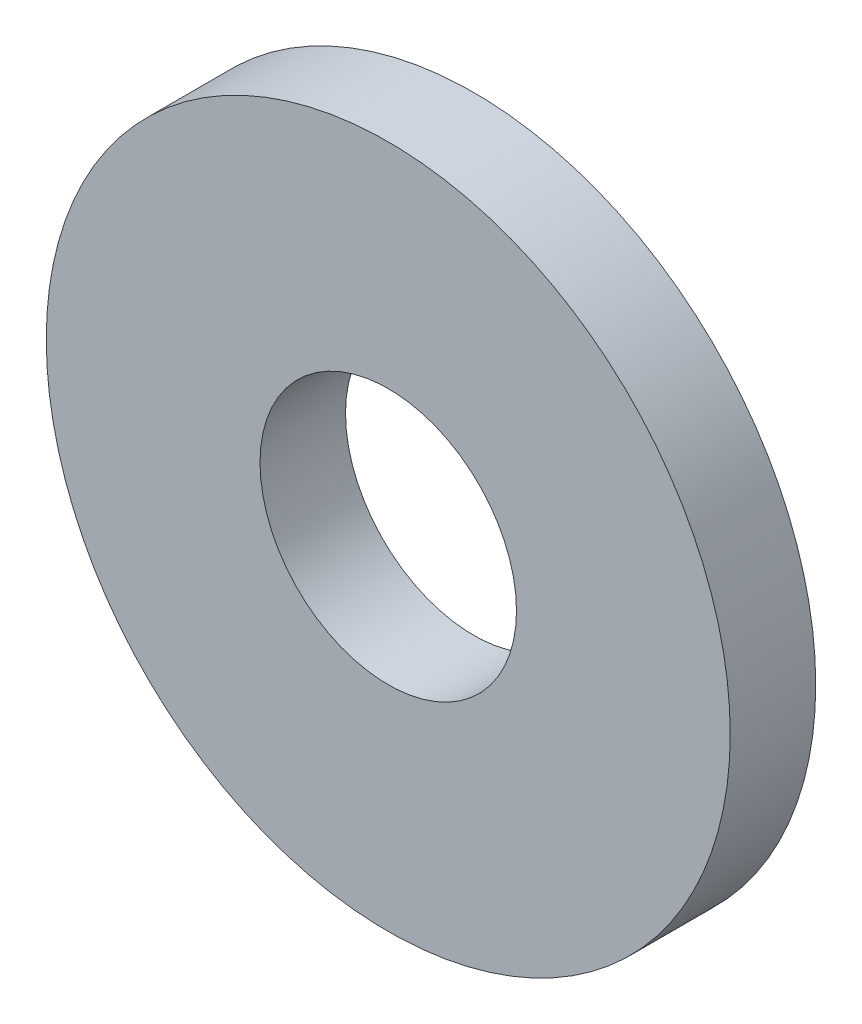
ISO-10303-21;
HEADER;
FILE_DESCRIPTION(('STEP AP214'),'2;1');
FILE_NAME('part.step','',(''),(''),'','','');
FILE_SCHEMA(('AUTOMOTIVE_DESIGN { 1 0 10303 214 1 1 1 1 }'));
ENDSEC;
DATA;
#1=APPLICATION_CONTEXT('core data for automotive mechanical design processes');
#2=APPLICATION_PROTOCOL_DEFINITION('international standard','automotive_design',2000,#1);
#3=PRODUCT_CONTEXT('',#1,'mechanical');
#4=PRODUCT('Part','Part','',(#3));
#5=PRODUCT_RELATED_PRODUCT_CATEGORY('part','',(#4));
#6=PRODUCT_DEFINITION_FORMATION('','',#4);
#7=PRODUCT_DEFINITION_CONTEXT('part definition',#1,'design');
#8=PRODUCT_DEFINITION('design','',#6,#7);
#9=PRODUCT_DEFINITION_SHAPE('','',#8);
#10=(LENGTH_UNIT() NAMED_UNIT(*) SI_UNIT(.MILLI.,.METRE.));
#11=(NAMED_UNIT(*) PLANE_ANGLE_UNIT() SI_UNIT($,.RADIAN.));
#12=(NAMED_UNIT(*) SI_UNIT($,.STERADIAN.) SOLID_ANGLE_UNIT());
#13=UNCERTAINTY_MEASURE_WITH_UNIT(LENGTH_MEASURE(1.E-05),#10,'distance_accuracy_value','');
#14=(GEOMETRIC_REPRESENTATION_CONTEXT(3) GLOBAL_UNCERTAINTY_ASSIGNED_CONTEXT((#13)) GLOBAL_UNIT_ASSIGNED_CONTEXT((#10,
#11,#12)) REPRESENTATION_CONTEXT('',''));
#15=CARTESIAN_POINT('',(0.,0.,0.));
#16=DIRECTION('',(0.,0.,1.));
#17=DIRECTION('',(1.,0.,0.));
#18=AXIS2_PLACEMENT_3D('',#15,#16,#17);
#19=CARTESIAN_POINT('',(0.,0.,0.));
#20=DIRECTION('',(0.,0.,1.));
#21=DIRECTION('',(1.,0.,0.));
#22=AXIS2_PLACEMENT_3D('',#19,#20,#21);
#23=PLANE('',#22);
#24=CARTESIAN_POINT('',(0.,0.,0.));
#25=DIRECTION('',(0.,0.,1.));
#26=DIRECTION('',(1.,0.,0.));
#27=AXIS2_PLACEMENT_3D('',#24,#25,#26);
#28=CIRCLE('',#27,4.);
#29=CARTESIAN_POINT('',(4.,0.,0.));
#30=VERTEX_POINT('',#29);
#31=EDGE_CURVE('E26',#30,#30,#28,.T.);
#32=ORIENTED_EDGE('',*,*,#31,.F.);
#33=EDGE_LOOP('',(#32));
#34=FACE_BOUND('',#33,.T.);
#35=CARTESIAN_POINT('',(0.,0.,0.));
#36=DIRECTION('',(0.,0.,1.));
#37=DIRECTION('',(1.,0.,0.));
#38=AXIS2_PLACEMENT_3D('',#35,#36,#37);
#39=CIRCLE('',#38,1.5);
#40=CARTESIAN_POINT('',(1.5,0.,0.));
#41=VERTEX_POINT('',#40);
#42=EDGE_CURVE('E17',#41,#41,#39,.T.);
#43=ORIENTED_EDGE('',*,*,#42,.T.);
#44=EDGE_LOOP('',(#43));
#45=FACE_BOUND('',#44,.T.);
#46=ADVANCED_FACE('F14',(#34,#45),#23,.F.);
#47=CARTESIAN_POINT('',(0.,0.,0.));
#48=DIRECTION('',(0.,0.,1.));
#49=DIRECTION('',(1.,0.,0.));
#50=AXIS2_PLACEMENT_3D('',#47,#48,#49);
#51=CYLINDRICAL_SURFACE('',#50,1.5);
#52=ORIENTED_EDGE('',*,*,#42,.F.);
#53=EDGE_LOOP('',(#52));
#54=FACE_BOUND('',#53,.T.);
#55=CARTESIAN_POINT('',(0.,0.,1.));
#56=DIRECTION('',(0.,0.,1.));
#57=DIRECTION('',(1.,0.,0.));
#58=AXIS2_PLACEMENT_3D('',#55,#56,#57);
#59=CIRCLE('',#58,1.5);
#60=CARTESIAN_POINT('',(1.5,0.,1.));
#61=VERTEX_POINT('',#60);
#62=EDGE_CURVE('E21',#61,#61,#59,.F.);
#63=ORIENTED_EDGE('',*,*,#62,.F.);
#64=EDGE_LOOP('',(#63));
#65=FACE_BOUND('',#64,.T.);
#66=ADVANCED_FACE('F35',(#54,#65),#51,.F.);
#67=CARTESIAN_POINT('',(0.,0.,0.));
#68=DIRECTION('',(0.,0.,1.));
#69=DIRECTION('',(1.,0.,0.));
#70=AXIS2_PLACEMENT_3D('',#67,#68,#69);
#71=CYLINDRICAL_SURFACE('',#70,4.);
#72=ORIENTED_EDGE('',*,*,#31,.T.);
#73=EDGE_LOOP('',(#72));
#74=FACE_BOUND('',#73,.T.);
#75=CARTESIAN_POINT('',(0.,0.,1.));
#76=DIRECTION('',(0.,0.,1.));
#77=DIRECTION('',(1.,0.,0.));
#78=AXIS2_PLACEMENT_3D('',#75,#76,#77);
#79=CIRCLE('',#78,4.);
#80=CARTESIAN_POINT('',(4.,0.,1.));
#81=VERTEX_POINT('',#80);
#82=EDGE_CURVE('E10',#81,#81,#79,.T.);
#83=ORIENTED_EDGE('',*,*,#82,.F.);
#84=EDGE_LOOP('',(#83));
#85=FACE_BOUND('',#84,.T.);
#86=ADVANCED_FACE('F38',(#74,#85),#71,.T.);
#87=CARTESIAN_POINT('',(0.,0.,1.));
#88=DIRECTION('',(0.,0.,1.));
#89=DIRECTION('',(1.,0.,0.));
#90=AXIS2_PLACEMENT_3D('',#87,#88,#89);
#91=PLANE('',#90);
#92=ORIENTED_EDGE('',*,*,#82,.T.);
#93=EDGE_LOOP('',(#92));
#94=FACE_BOUND('',#93,.T.);
#95=ORIENTED_EDGE('',*,*,#62,.T.);
#96=EDGE_LOOP('',(#95));
#97=FACE_BOUND('',#96,.T.);
#98=ADVANCED_FACE('F41',(#94,#97),#91,.T.);
#99=CLOSED_SHELL('',(#46,#66,#86,#98));
#100=MANIFOLD_SOLID_BREP('B1',#99);
#101=ADVANCED_BREP_SHAPE_REPRESENTATION('',(#18,#100),#14);
#102=SHAPE_DEFINITION_REPRESENTATION(#9,#101);
ENDSEC;
END-ISO-10303-21;
